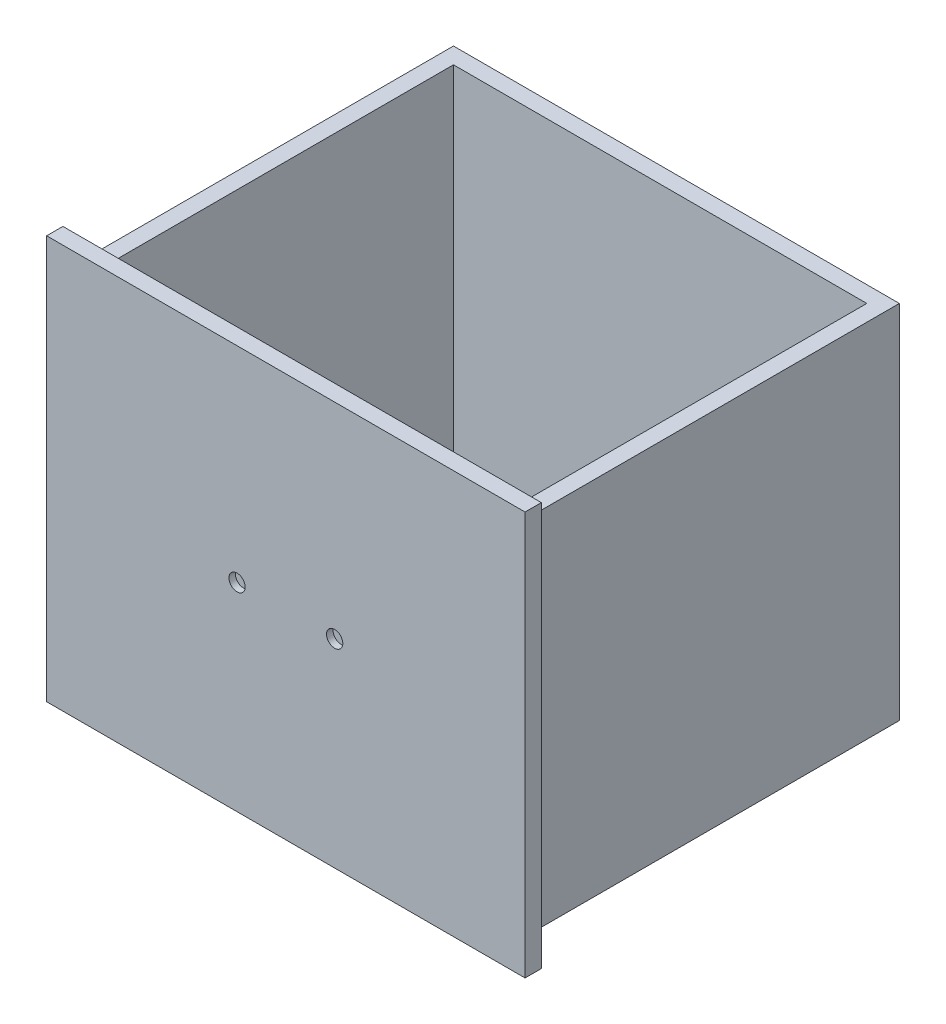
ISO-10303-21;
HEADER;
FILE_DESCRIPTION(('STEP AP214'),'2;1');
FILE_NAME('part.step','',(''),(''),'','','');
FILE_SCHEMA(('AUTOMOTIVE_DESIGN { 1 0 10303 214 1 1 1 1 }'));
ENDSEC;
DATA;
#1=APPLICATION_CONTEXT('core data for automotive mechanical design processes');
#2=APPLICATION_PROTOCOL_DEFINITION('international standard','automotive_design',2000,#1);
#3=PRODUCT_CONTEXT('',#1,'mechanical');
#4=PRODUCT('Part','Part','',(#3));
#5=PRODUCT_RELATED_PRODUCT_CATEGORY('part','',(#4));
#6=PRODUCT_DEFINITION_FORMATION('','',#4);
#7=PRODUCT_DEFINITION_CONTEXT('part definition',#1,'design');
#8=PRODUCT_DEFINITION('design','',#6,#7);
#9=PRODUCT_DEFINITION_SHAPE('','',#8);
#10=(LENGTH_UNIT() NAMED_UNIT(*) SI_UNIT(.MILLI.,.METRE.));
#11=(NAMED_UNIT(*) PLANE_ANGLE_UNIT() SI_UNIT($,.RADIAN.));
#12=(NAMED_UNIT(*) SI_UNIT($,.STERADIAN.) SOLID_ANGLE_UNIT());
#13=UNCERTAINTY_MEASURE_WITH_UNIT(LENGTH_MEASURE(1.E-05),#10,'distance_accuracy_value','');
#14=(GEOMETRIC_REPRESENTATION_CONTEXT(3) GLOBAL_UNCERTAINTY_ASSIGNED_CONTEXT((#13)) GLOBAL_UNIT_ASSIGNED_CONTEXT((#10,
#11,#12)) REPRESENTATION_CONTEXT('',''));
#15=CARTESIAN_POINT('',(0.,0.,0.));
#16=DIRECTION('',(0.,0.,1.));
#17=DIRECTION('',(1.,0.,0.));
#18=AXIS2_PLACEMENT_3D('',#15,#16,#17);
#19=CARTESIAN_POINT('',(0.,0.,-12.7));
#20=DIRECTION('',(0.,0.,1.));
#21=DIRECTION('',(1.,0.,0.));
#22=AXIS2_PLACEMENT_3D('',#19,#20,#21);
#23=PLANE('',#22);
#24=DIRECTION('',(0.,1.,0.));
#25=VECTOR('',#24,1.);
#26=CARTESIAN_POINT('',(186.69,154.94,-12.7));
#27=LINE('',#26,#25);
#28=CARTESIAN_POINT('',(186.69,-154.94,-12.7));
#29=VERTEX_POINT('',#28);
#30=CARTESIAN_POINT('',(186.69,160.02,-12.7));
#31=VERTEX_POINT('',#30);
#32=EDGE_CURVE('E122',#29,#31,#27,.T.);
#33=ORIENTED_EDGE('',*,*,#32,.F.);
#34=DIRECTION('',(1.,0.,0.));
#35=VECTOR('',#34,1.);
#36=CARTESIAN_POINT('',(-186.69,-154.94,-12.7));
#37=LINE('',#36,#35);
#38=CARTESIAN_POINT('',(-186.69,-154.94,-12.7));
#39=VERTEX_POINT('',#38);
#40=EDGE_CURVE('E221',#39,#29,#37,.T.);
#41=ORIENTED_EDGE('',*,*,#40,.F.);
#42=DIRECTION('',(0.,-1.,0.));
#43=VECTOR('',#42,1.);
#44=CARTESIAN_POINT('',(-186.69,154.94,-12.7));
#45=LINE('',#44,#43);
#46=CARTESIAN_POINT('',(-186.69,160.02,-12.7));
#47=VERTEX_POINT('',#46);
#48=EDGE_CURVE('E131',#47,#39,#45,.T.);
#49=ORIENTED_EDGE('',*,*,#48,.F.);
#50=DIRECTION('',(-1.,0.,0.));
#51=VECTOR('',#50,1.);
#52=CARTESIAN_POINT('',(-186.69,160.02,-12.7));
#53=LINE('',#52,#51);
#54=EDGE_CURVE('E138',#31,#47,#53,.T.);
#55=ORIENTED_EDGE('',*,*,#54,.F.);
#56=EDGE_LOOP('',(#33,#41,#49,#55));
#57=FACE_BOUND('',#56,.T.);
#58=DIRECTION('',(-1.,0.,0.));
#59=VECTOR('',#58,1.);
#60=CARTESIAN_POINT('',(173.99,-139.7,-12.7));
#61=LINE('',#60,#59);
#62=CARTESIAN_POINT('',(173.99,-139.7,-12.7));
#63=VERTEX_POINT('',#62);
#64=CARTESIAN_POINT('',(-173.99,-139.7,-12.7));
#65=VERTEX_POINT('',#64);
#66=EDGE_CURVE('E56',#63,#65,#61,.T.);
#67=ORIENTED_EDGE('',*,*,#66,.F.);
#68=DIRECTION('',(0.,-1.,0.));
#69=VECTOR('',#68,1.);
#70=CARTESIAN_POINT('',(173.99,142.24,-12.7));
#71=LINE('',#70,#69);
#72=CARTESIAN_POINT('',(173.99,142.24,-12.7));
#73=VERTEX_POINT('',#72);
#74=EDGE_CURVE('E192',#73,#63,#71,.T.);
#75=ORIENTED_EDGE('',*,*,#74,.F.);
#76=DIRECTION('',(1.,0.,0.));
#77=VECTOR('',#76,1.);
#78=CARTESIAN_POINT('',(173.99,142.24,-12.7));
#79=LINE('',#78,#77);
#80=CARTESIAN_POINT('',(161.29,142.24,-12.7));
#81=VERTEX_POINT('',#80);
#82=EDGE_CURVE('E203',#81,#73,#79,.T.);
#83=ORIENTED_EDGE('',*,*,#82,.F.);
#84=DIRECTION('',(0.,1.,0.));
#85=VECTOR('',#84,1.);
#86=CARTESIAN_POINT('',(161.29,-124.46,-12.7));
#87=LINE('',#86,#85);
#88=CARTESIAN_POINT('',(161.29,-124.46,-12.7));
#89=VERTEX_POINT('',#88);
#90=EDGE_CURVE('E185',#89,#81,#87,.T.);
#91=ORIENTED_EDGE('',*,*,#90,.F.);
#92=DIRECTION('',(1.,0.,0.));
#93=VECTOR('',#92,1.);
#94=CARTESIAN_POINT('',(-161.29,-124.46,-12.7));
#95=LINE('',#94,#93);
#96=CARTESIAN_POINT('',(-161.29,-124.46,-12.7));
#97=VERTEX_POINT('',#96);
#98=EDGE_CURVE('E164',#97,#89,#95,.T.);
#99=ORIENTED_EDGE('',*,*,#98,.F.);
#100=DIRECTION('',(0.,1.,0.));
#101=VECTOR('',#100,1.);
#102=CARTESIAN_POINT('',(-161.29,-124.46,-12.7));
#103=LINE('',#102,#101);
#104=CARTESIAN_POINT('',(-161.29,142.24,-12.7));
#105=VERTEX_POINT('',#104);
#106=EDGE_CURVE('E174',#97,#105,#103,.T.);
#107=ORIENTED_EDGE('',*,*,#106,.T.);
#108=CARTESIAN_POINT('',(-173.99,142.24,-12.7));
#109=VERTEX_POINT('',#108);
#110=EDGE_CURVE('E204',#109,#105,#79,.T.);
#111=ORIENTED_EDGE('',*,*,#110,.F.);
#112=DIRECTION('',(0.,1.,0.));
#113=VECTOR('',#112,1.);
#114=CARTESIAN_POINT('',(-173.99,142.24,-12.7));
#115=LINE('',#114,#113);
#116=EDGE_CURVE('E200',#65,#109,#115,.T.);
#117=ORIENTED_EDGE('',*,*,#116,.F.);
#118=EDGE_LOOP('',(#67,#75,#83,#91,#99,#107,#111,#117));
#119=FACE_BOUND('',#118,.T.);
#120=ADVANCED_FACE('F33',(#57,#119),#23,.F.);
#121=CARTESIAN_POINT('',(186.69,154.94,-12.7));
#122=DIRECTION('',(1.,0.,0.));
#123=DIRECTION('',(0.,1.,0.));
#124=AXIS2_PLACEMENT_3D('',#121,#122,#123);
#125=PLANE('',#124);
#126=DIRECTION('',(0.,1.,0.));
#127=VECTOR('',#126,1.);
#128=CARTESIAN_POINT('',(186.69,154.94,0.));
#129=LINE('',#128,#127);
#130=CARTESIAN_POINT('',(186.69,-154.94,0.));
#131=VERTEX_POINT('',#130);
#132=CARTESIAN_POINT('',(186.69,160.02,0.));
#133=VERTEX_POINT('',#132);
#134=EDGE_CURVE('E218',#131,#133,#129,.T.);
#135=ORIENTED_EDGE('',*,*,#134,.F.);
#136=DIRECTION('',(0.,0.,1.));
#137=VECTOR('',#136,1.);
#138=CARTESIAN_POINT('',(186.69,-154.94,-12.7));
#139=LINE('',#138,#137);
#140=EDGE_CURVE('E11',#29,#131,#139,.T.);
#141=ORIENTED_EDGE('',*,*,#140,.F.);
#142=ORIENTED_EDGE('',*,*,#32,.T.);
#143=DIRECTION('',(0.,0.,1.));
#144=VECTOR('',#143,1.);
#145=CARTESIAN_POINT('',(186.69,160.02,-12.7));
#146=LINE('',#145,#144);
#147=EDGE_CURVE('E125',#31,#133,#146,.T.);
#148=ORIENTED_EDGE('',*,*,#147,.T.);
#149=EDGE_LOOP('',(#135,#141,#142,#148));
#150=FACE_BOUND('',#149,.T.);
#151=ADVANCED_FACE('F35',(#150),#125,.T.);
#152=CARTESIAN_POINT('',(-186.69,-154.94,-12.7));
#153=DIRECTION('',(0.,-1.,0.));
#154=DIRECTION('',(0.,0.,-1.));
#155=AXIS2_PLACEMENT_3D('',#152,#153,#154);
#156=PLANE('',#155);
#157=DIRECTION('',(1.,0.,0.));
#158=VECTOR('',#157,1.);
#159=CARTESIAN_POINT('',(-186.69,-154.94,0.));
#160=LINE('',#159,#158);
#161=CARTESIAN_POINT('',(-186.69,-154.94,0.));
#162=VERTEX_POINT('',#161);
#163=EDGE_CURVE('E132',#162,#131,#160,.T.);
#164=ORIENTED_EDGE('',*,*,#163,.F.);
#165=DIRECTION('',(0.,0.,1.));
#166=VECTOR('',#165,1.);
#167=CARTESIAN_POINT('',(-186.69,-154.94,-12.7));
#168=LINE('',#167,#166);
#169=EDGE_CURVE('E37',#39,#162,#168,.T.);
#170=ORIENTED_EDGE('',*,*,#169,.F.);
#171=ORIENTED_EDGE('',*,*,#40,.T.);
#172=ORIENTED_EDGE('',*,*,#140,.T.);
#173=EDGE_LOOP('',(#164,#170,#171,#172));
#174=FACE_BOUND('',#173,.T.);
#175=ADVANCED_FACE('F232',(#174),#156,.T.);
#176=CARTESIAN_POINT('',(-186.69,154.94,-12.7));
#177=DIRECTION('',(-1.,0.,0.));
#178=DIRECTION('',(0.,-1.,0.));
#179=AXIS2_PLACEMENT_3D('',#176,#177,#178);
#180=PLANE('',#179);
#181=DIRECTION('',(0.,-1.,0.));
#182=VECTOR('',#181,1.);
#183=CARTESIAN_POINT('',(-186.69,154.94,0.));
#184=LINE('',#183,#182);
#185=CARTESIAN_POINT('',(-186.69,160.02,0.));
#186=VERTEX_POINT('',#185);
#187=EDGE_CURVE('E224',#186,#162,#184,.T.);
#188=ORIENTED_EDGE('',*,*,#187,.F.);
#189=DIRECTION('',(0.,0.,1.));
#190=VECTOR('',#189,1.);
#191=CARTESIAN_POINT('',(-186.69,160.02,-12.7));
#192=LINE('',#191,#190);
#193=EDGE_CURVE('E141',#47,#186,#192,.T.);
#194=ORIENTED_EDGE('',*,*,#193,.F.);
#195=ORIENTED_EDGE('',*,*,#48,.T.);
#196=ORIENTED_EDGE('',*,*,#169,.T.);
#197=EDGE_LOOP('',(#188,#194,#195,#196));
#198=FACE_BOUND('',#197,.T.);
#199=ADVANCED_FACE('F234',(#198),#180,.T.);
#200=CARTESIAN_POINT('',(0.,0.,0.));
#201=DIRECTION('',(0.,0.,1.));
#202=DIRECTION('',(1.,0.,0.));
#203=AXIS2_PLACEMENT_3D('',#200,#201,#202);
#204=PLANE('',#203);
#205=CARTESIAN_POINT('',(-38.1,0.,0.));
#206=DIRECTION('',(0.,0.,1.));
#207=DIRECTION('',(1.,0.,0.));
#208=AXIS2_PLACEMENT_3D('',#205,#206,#207);
#209=CIRCLE('',#208,6.35);
#210=CARTESIAN_POINT('',(-31.75,0.,0.));
#211=VERTEX_POINT('',#210);
#212=EDGE_CURVE('E153',#211,#211,#209,.T.);
#213=ORIENTED_EDGE('',*,*,#212,.F.);
#214=EDGE_LOOP('',(#213));
#215=FACE_BOUND('',#214,.T.);
#216=CARTESIAN_POINT('',(38.1,0.,0.));
#217=DIRECTION('',(0.,0.,1.));
#218=DIRECTION('',(1.,0.,0.));
#219=AXIS2_PLACEMENT_3D('',#216,#217,#218);
#220=CIRCLE('',#219,6.35);
#221=CARTESIAN_POINT('',(44.45,0.,0.));
#222=VERTEX_POINT('',#221);
#223=EDGE_CURVE('E148',#222,#222,#220,.T.);
#224=ORIENTED_EDGE('',*,*,#223,.F.);
#225=EDGE_LOOP('',(#224));
#226=FACE_BOUND('',#225,.T.);
#227=ORIENTED_EDGE('',*,*,#134,.T.);
#228=DIRECTION('',(-1.,0.,0.));
#229=VECTOR('',#228,1.);
#230=CARTESIAN_POINT('',(-186.69,160.02,0.));
#231=LINE('',#230,#229);
#232=EDGE_CURVE('E140',#133,#186,#231,.T.);
#233=ORIENTED_EDGE('',*,*,#232,.T.);
#234=ORIENTED_EDGE('',*,*,#187,.T.);
#235=ORIENTED_EDGE('',*,*,#163,.T.);
#236=EDGE_LOOP('',(#227,#233,#234,#235));
#237=FACE_BOUND('',#236,.T.);
#238=ADVANCED_FACE('F230',(#215,#226,#237),#204,.T.);
#239=CARTESIAN_POINT('',(173.99,-139.7,-304.8));
#240=DIRECTION('',(0.,1.,0.));
#241=DIRECTION('',(0.,0.,1.));
#242=AXIS2_PLACEMENT_3D('',#239,#240,#241);
#243=PLANE('',#242);
#244=ORIENTED_EDGE('',*,*,#66,.T.);
#245=DIRECTION('',(0.,0.,1.));
#246=VECTOR('',#245,1.);
#247=CARTESIAN_POINT('',(-173.99,-139.7,-304.8));
#248=LINE('',#247,#246);
#249=CARTESIAN_POINT('',(-173.99,-139.7,-304.8));
#250=VERTEX_POINT('',#249);
#251=EDGE_CURVE('E216',#250,#65,#248,.T.);
#252=ORIENTED_EDGE('',*,*,#251,.F.);
#253=DIRECTION('',(-1.,0.,0.));
#254=VECTOR('',#253,1.);
#255=CARTESIAN_POINT('',(173.99,-139.7,-304.8));
#256=LINE('',#255,#254);
#257=CARTESIAN_POINT('',(173.99,-139.7,-304.8));
#258=VERTEX_POINT('',#257);
#259=EDGE_CURVE('E188',#258,#250,#256,.T.);
#260=ORIENTED_EDGE('',*,*,#259,.F.);
#261=DIRECTION('',(0.,0.,1.));
#262=VECTOR('',#261,1.);
#263=CARTESIAN_POINT('',(173.99,-139.7,-304.8));
#264=LINE('',#263,#262);
#265=EDGE_CURVE('E198',#258,#63,#264,.T.);
#266=ORIENTED_EDGE('',*,*,#265,.T.);
#267=EDGE_LOOP('',(#244,#252,#260,#266));
#268=FACE_BOUND('',#267,.T.);
#269=ADVANCED_FACE('F240',(#268),#243,.F.);
#270=CARTESIAN_POINT('',(-173.99,142.24,-304.8));
#271=DIRECTION('',(1.,0.,0.));
#272=DIRECTION('',(0.,1.,0.));
#273=AXIS2_PLACEMENT_3D('',#270,#271,#272);
#274=PLANE('',#273);
#275=ORIENTED_EDGE('',*,*,#116,.T.);
#276=DIRECTION('',(0.,0.,1.));
#277=VECTOR('',#276,1.);
#278=CARTESIAN_POINT('',(-173.99,142.24,-304.8));
#279=LINE('',#278,#277);
#280=CARTESIAN_POINT('',(-173.99,142.24,-304.8));
#281=VERTEX_POINT('',#280);
#282=EDGE_CURVE('E213',#281,#109,#279,.T.);
#283=ORIENTED_EDGE('',*,*,#282,.F.);
#284=DIRECTION('',(0.,1.,0.));
#285=VECTOR('',#284,1.);
#286=CARTESIAN_POINT('',(-173.99,142.24,-304.8));
#287=LINE('',#286,#285);
#288=EDGE_CURVE('E191',#250,#281,#287,.T.);
#289=ORIENTED_EDGE('',*,*,#288,.F.);
#290=ORIENTED_EDGE('',*,*,#251,.T.);
#291=EDGE_LOOP('',(#275,#283,#289,#290));
#292=FACE_BOUND('',#291,.T.);
#293=ADVANCED_FACE('F252',(#292),#274,.F.);
#294=CARTESIAN_POINT('',(173.99,142.24,-304.8));
#295=DIRECTION('',(0.,-1.,0.));
#296=DIRECTION('',(0.,0.,-1.));
#297=AXIS2_PLACEMENT_3D('',#294,#295,#296);
#298=PLANE('',#297);
#299=ORIENTED_EDGE('',*,*,#110,.T.);
#300=DIRECTION('',(0.,0.,1.));
#301=VECTOR('',#300,1.);
#302=CARTESIAN_POINT('',(-161.29,142.24,-292.1));
#303=LINE('',#302,#301);
#304=CARTESIAN_POINT('',(-161.29,142.24,-292.1));
#305=VERTEX_POINT('',#304);
#306=EDGE_CURVE('E48',#305,#105,#303,.T.);
#307=ORIENTED_EDGE('',*,*,#306,.F.);
#308=DIRECTION('',(-1.,0.,0.));
#309=VECTOR('',#308,1.);
#310=CARTESIAN_POINT('',(-161.29,142.24,-292.1));
#311=LINE('',#310,#309);
#312=CARTESIAN_POINT('',(161.29,142.24,-292.1));
#313=VERTEX_POINT('',#312);
#314=EDGE_CURVE('E165',#313,#305,#311,.T.);
#315=ORIENTED_EDGE('',*,*,#314,.F.);
#316=DIRECTION('',(0.,0.,-1.));
#317=VECTOR('',#316,1.);
#318=CARTESIAN_POINT('',(161.29,142.24,-292.1));
#319=LINE('',#318,#317);
#320=EDGE_CURVE('E176',#81,#313,#319,.T.);
#321=ORIENTED_EDGE('',*,*,#320,.F.);
#322=ORIENTED_EDGE('',*,*,#82,.T.);
#323=DIRECTION('',(0.,0.,1.));
#324=VECTOR('',#323,1.);
#325=CARTESIAN_POINT('',(173.99,142.24,-304.8));
#326=LINE('',#325,#324);
#327=CARTESIAN_POINT('',(173.99,142.24,-304.8));
#328=VERTEX_POINT('',#327);
#329=EDGE_CURVE('E210',#328,#73,#326,.T.);
#330=ORIENTED_EDGE('',*,*,#329,.F.);
#331=DIRECTION('',(1.,0.,0.));
#332=VECTOR('',#331,1.);
#333=CARTESIAN_POINT('',(173.99,142.24,-304.8));
#334=LINE('',#333,#332);
#335=EDGE_CURVE('E194',#281,#328,#334,.T.);
#336=ORIENTED_EDGE('',*,*,#335,.F.);
#337=ORIENTED_EDGE('',*,*,#282,.T.);
#338=EDGE_LOOP('',(#299,#307,#315,#321,#322,#330,#336,#337));
#339=FACE_BOUND('',#338,.T.);
#340=ADVANCED_FACE('F256',(#339),#298,.F.);
#341=CARTESIAN_POINT('',(173.99,142.24,-304.8));
#342=DIRECTION('',(-1.,0.,0.));
#343=DIRECTION('',(0.,-1.,0.));
#344=AXIS2_PLACEMENT_3D('',#341,#342,#343);
#345=PLANE('',#344);
#346=ORIENTED_EDGE('',*,*,#74,.T.);
#347=ORIENTED_EDGE('',*,*,#265,.F.);
#348=DIRECTION('',(0.,-1.,0.));
#349=VECTOR('',#348,1.);
#350=CARTESIAN_POINT('',(173.99,142.24,-304.8));
#351=LINE('',#350,#349);
#352=EDGE_CURVE('E196',#328,#258,#351,.T.);
#353=ORIENTED_EDGE('',*,*,#352,.F.);
#354=ORIENTED_EDGE('',*,*,#329,.T.);
#355=EDGE_LOOP('',(#346,#347,#353,#354));
#356=FACE_BOUND('',#355,.T.);
#357=ADVANCED_FACE('F260',(#356),#345,.F.);
#358=CARTESIAN_POINT('',(0.,0.,-304.8));
#359=DIRECTION('',(0.,0.,1.));
#360=DIRECTION('',(1.,0.,0.));
#361=AXIS2_PLACEMENT_3D('',#358,#359,#360);
#362=PLANE('',#361);
#363=ORIENTED_EDGE('',*,*,#259,.T.);
#364=ORIENTED_EDGE('',*,*,#288,.T.);
#365=ORIENTED_EDGE('',*,*,#335,.T.);
#366=ORIENTED_EDGE('',*,*,#352,.T.);
#367=EDGE_LOOP('',(#363,#364,#365,#366));
#368=FACE_BOUND('',#367,.T.);
#369=ADVANCED_FACE('F264',(#368),#362,.F.);
#370=CARTESIAN_POINT('',(-161.29,-124.46,-292.1));
#371=DIRECTION('',(-1.,0.,0.));
#372=DIRECTION('',(0.,0.,1.));
#373=AXIS2_PLACEMENT_3D('',#370,#371,#372);
#374=PLANE('',#373);
#375=ORIENTED_EDGE('',*,*,#306,.T.);
#376=ORIENTED_EDGE('',*,*,#106,.F.);
#377=DIRECTION('',(0.,0.,1.));
#378=VECTOR('',#377,1.);
#379=CARTESIAN_POINT('',(-161.29,-124.46,-292.1));
#380=LINE('',#379,#378);
#381=CARTESIAN_POINT('',(-161.29,-124.46,-292.1));
#382=VERTEX_POINT('',#381);
#383=EDGE_CURVE('E161',#382,#97,#380,.T.);
#384=ORIENTED_EDGE('',*,*,#383,.F.);
#385=DIRECTION('',(0.,1.,0.));
#386=VECTOR('',#385,1.);
#387=CARTESIAN_POINT('',(-161.29,-124.46,-292.1));
#388=LINE('',#387,#386);
#389=EDGE_CURVE('E181',#382,#305,#388,.T.);
#390=ORIENTED_EDGE('',*,*,#389,.T.);
#391=EDGE_LOOP('',(#375,#376,#384,#390));
#392=FACE_BOUND('',#391,.T.);
#393=ADVANCED_FACE('F268',(#392),#374,.F.);
#394=CARTESIAN_POINT('',(-161.29,-124.46,-292.1));
#395=DIRECTION('',(0.,0.,-1.));
#396=DIRECTION('',(-1.,0.,0.));
#397=AXIS2_PLACEMENT_3D('',#394,#395,#396);
#398=PLANE('',#397);
#399=ORIENTED_EDGE('',*,*,#314,.T.);
#400=ORIENTED_EDGE('',*,*,#389,.F.);
#401=DIRECTION('',(-1.,0.,0.));
#402=VECTOR('',#401,1.);
#403=CARTESIAN_POINT('',(-161.29,-124.46,-292.1));
#404=LINE('',#403,#402);
#405=CARTESIAN_POINT('',(161.29,-124.46,-292.1));
#406=VERTEX_POINT('',#405);
#407=EDGE_CURVE('E171',#406,#382,#404,.T.);
#408=ORIENTED_EDGE('',*,*,#407,.F.);
#409=DIRECTION('',(0.,1.,0.));
#410=VECTOR('',#409,1.);
#411=CARTESIAN_POINT('',(161.29,-124.46,-292.1));
#412=LINE('',#411,#410);
#413=EDGE_CURVE('E183',#406,#313,#412,.T.);
#414=ORIENTED_EDGE('',*,*,#413,.T.);
#415=EDGE_LOOP('',(#399,#400,#408,#414));
#416=FACE_BOUND('',#415,.T.);
#417=ADVANCED_FACE('F272',(#416),#398,.F.);
#418=CARTESIAN_POINT('',(161.29,-124.46,-292.1));
#419=DIRECTION('',(1.,0.,0.));
#420=DIRECTION('',(0.,0.,-1.));
#421=AXIS2_PLACEMENT_3D('',#418,#419,#420);
#422=PLANE('',#421);
#423=ORIENTED_EDGE('',*,*,#320,.T.);
#424=ORIENTED_EDGE('',*,*,#413,.F.);
#425=DIRECTION('',(0.,0.,-1.));
#426=VECTOR('',#425,1.);
#427=CARTESIAN_POINT('',(161.29,-124.46,-292.1));
#428=LINE('',#427,#426);
#429=EDGE_CURVE('E168',#89,#406,#428,.T.);
#430=ORIENTED_EDGE('',*,*,#429,.F.);
#431=ORIENTED_EDGE('',*,*,#90,.T.);
#432=EDGE_LOOP('',(#423,#424,#430,#431));
#433=FACE_BOUND('',#432,.T.);
#434=ADVANCED_FACE('F273',(#433),#422,.F.);
#435=CARTESIAN_POINT('',(0.,-124.46,0.));
#436=DIRECTION('',(0.,1.,0.));
#437=DIRECTION('',(0.,0.,1.));
#438=AXIS2_PLACEMENT_3D('',#435,#436,#437);
#439=PLANE('',#438);
#440=ORIENTED_EDGE('',*,*,#383,.T.);
#441=ORIENTED_EDGE('',*,*,#98,.T.);
#442=ORIENTED_EDGE('',*,*,#429,.T.);
#443=ORIENTED_EDGE('',*,*,#407,.T.);
#444=EDGE_LOOP('',(#440,#441,#442,#443));
#445=FACE_BOUND('',#444,.T.);
#446=ADVANCED_FACE('F276',(#445),#439,.T.);
#447=CARTESIAN_POINT('',(38.1,0.,-5.08));
#448=DIRECTION('',(0.,0.,1.));
#449=DIRECTION('',(1.,0.,0.));
#450=AXIS2_PLACEMENT_3D('',#447,#448,#449);
#451=CYLINDRICAL_SURFACE('',#450,6.35);
#452=CARTESIAN_POINT('',(38.1,0.,-5.08));
#453=DIRECTION('',(0.,0.,1.));
#454=DIRECTION('',(1.,0.,0.));
#455=AXIS2_PLACEMENT_3D('',#452,#453,#454);
#456=CIRCLE('',#455,6.35);
#457=CARTESIAN_POINT('',(44.45,0.,-5.08));
#458=VERTEX_POINT('',#457);
#459=EDGE_CURVE('E156',#458,#458,#456,.T.);
#460=ORIENTED_EDGE('',*,*,#459,.F.);
#461=EDGE_LOOP('',(#460));
#462=FACE_BOUND('',#461,.T.);
#463=ORIENTED_EDGE('',*,*,#223,.T.);
#464=EDGE_LOOP('',(#463));
#465=FACE_BOUND('',#464,.T.);
#466=ADVANCED_FACE('F283',(#462,#465),#451,.F.);
#467=CARTESIAN_POINT('',(38.1,0.,-5.08));
#468=DIRECTION('',(0.,0.,1.));
#469=DIRECTION('',(1.,0.,0.));
#470=AXIS2_PLACEMENT_3D('',#467,#468,#469);
#471=PLANE('',#470);
#472=ORIENTED_EDGE('',*,*,#459,.T.);
#473=EDGE_LOOP('',(#472));
#474=FACE_BOUND('',#473,.T.);
#475=ADVANCED_FACE('F287',(#474),#471,.T.);
#476=CARTESIAN_POINT('',(-38.1,0.,-5.08));
#477=DIRECTION('',(0.,0.,1.));
#478=DIRECTION('',(1.,0.,0.));
#479=AXIS2_PLACEMENT_3D('',#476,#477,#478);
#480=CYLINDRICAL_SURFACE('',#479,6.35);
#481=CARTESIAN_POINT('',(-38.1,0.,-5.08));
#482=DIRECTION('',(0.,0.,1.));
#483=DIRECTION('',(1.,0.,0.));
#484=AXIS2_PLACEMENT_3D('',#481,#482,#483);
#485=CIRCLE('',#484,6.35);
#486=CARTESIAN_POINT('',(-31.75,0.,-5.08));
#487=VERTEX_POINT('',#486);
#488=EDGE_CURVE('E150',#487,#487,#485,.T.);
#489=ORIENTED_EDGE('',*,*,#488,.F.);
#490=EDGE_LOOP('',(#489));
#491=FACE_BOUND('',#490,.T.);
#492=ORIENTED_EDGE('',*,*,#212,.T.);
#493=EDGE_LOOP('',(#492));
#494=FACE_BOUND('',#493,.T.);
#495=ADVANCED_FACE('F291',(#491,#494),#480,.F.);
#496=CARTESIAN_POINT('',(-38.1,0.,-5.08));
#497=DIRECTION('',(0.,0.,1.));
#498=DIRECTION('',(1.,0.,0.));
#499=AXIS2_PLACEMENT_3D('',#496,#497,#498);
#500=PLANE('',#499);
#501=ORIENTED_EDGE('',*,*,#488,.T.);
#502=EDGE_LOOP('',(#501));
#503=FACE_BOUND('',#502,.T.);
#504=ADVANCED_FACE('F295',(#503),#500,.T.);
#505=CARTESIAN_POINT('',(-186.69,160.02,-12.7));
#506=DIRECTION('',(0.,1.,0.));
#507=DIRECTION('',(0.,0.,1.));
#508=AXIS2_PLACEMENT_3D('',#505,#506,#507);
#509=PLANE('',#508);
#510=ORIENTED_EDGE('',*,*,#232,.F.);
#511=ORIENTED_EDGE('',*,*,#147,.F.);
#512=ORIENTED_EDGE('',*,*,#54,.T.);
#513=ORIENTED_EDGE('',*,*,#193,.T.);
#514=EDGE_LOOP('',(#510,#511,#512,#513));
#515=FACE_BOUND('',#514,.T.);
#516=ADVANCED_FACE('F136',(#515),#509,.T.);
#517=CLOSED_SHELL('',(#120,#151,#175,#199,#238,#269,#293,#340,#357,#369,#393,#417,#434,#446,
#466,#475,#495,#504,#516));
#518=MANIFOLD_SOLID_BREP('B2',#517);
#519=ADVANCED_BREP_SHAPE_REPRESENTATION('',(#18,#518),#14);
#520=SHAPE_DEFINITION_REPRESENTATION(#9,#519);
ENDSEC;
END-ISO-10303-21;
